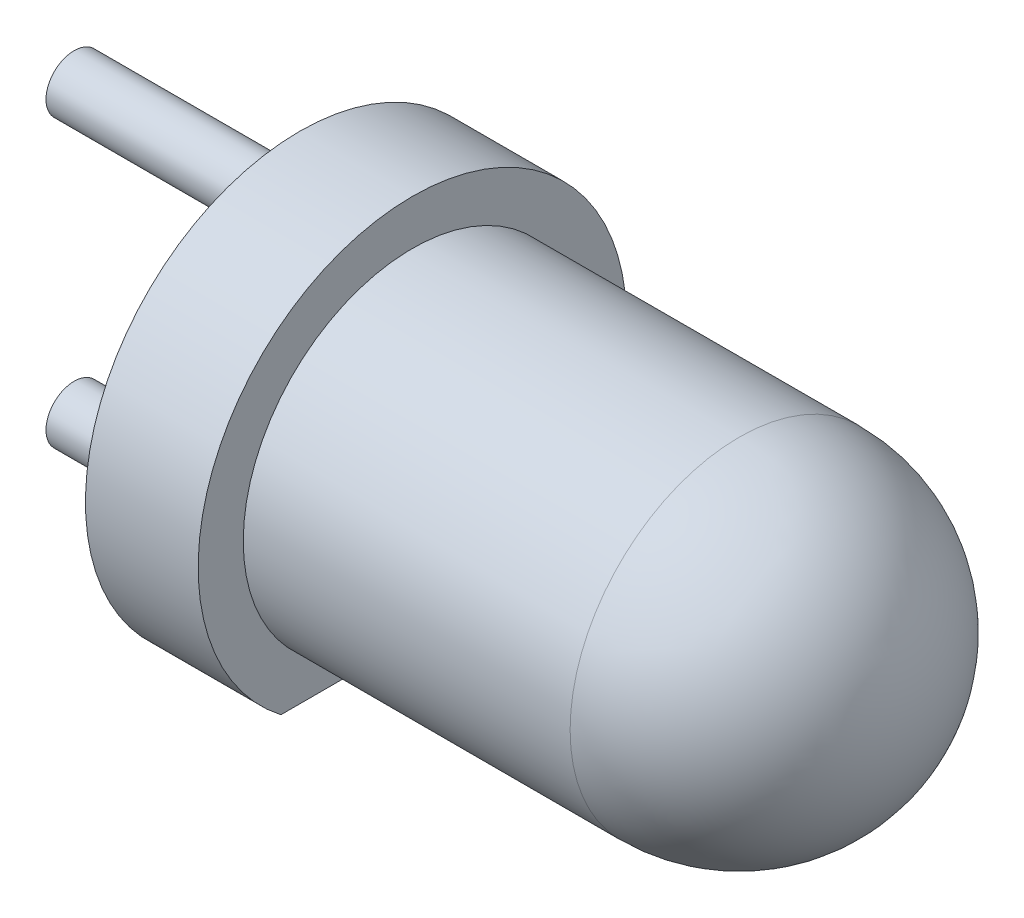
ISO-10303-21;
HEADER;
FILE_DESCRIPTION(('STEP AP214'),'2;1');
FILE_NAME('part.step','',(''),(''),'','','');
FILE_SCHEMA(('AUTOMOTIVE_DESIGN { 1 0 10303 214 1 1 1 1 }'));
ENDSEC;
DATA;
#1=APPLICATION_CONTEXT('core data for automotive mechanical design processes');
#2=APPLICATION_PROTOCOL_DEFINITION('international standard','automotive_design',2000,#1);
#3=PRODUCT_CONTEXT('',#1,'mechanical');
#4=PRODUCT('Part','Part','',(#3));
#5=PRODUCT_RELATED_PRODUCT_CATEGORY('part','',(#4));
#6=PRODUCT_DEFINITION_FORMATION('','',#4);
#7=PRODUCT_DEFINITION_CONTEXT('part definition',#1,'design');
#8=PRODUCT_DEFINITION('design','',#6,#7);
#9=PRODUCT_DEFINITION_SHAPE('','',#8);
#10=(LENGTH_UNIT() NAMED_UNIT(*) SI_UNIT(.MILLI.,.METRE.));
#11=(NAMED_UNIT(*) PLANE_ANGLE_UNIT() SI_UNIT($,.RADIAN.));
#12=(NAMED_UNIT(*) SI_UNIT($,.STERADIAN.) SOLID_ANGLE_UNIT());
#13=UNCERTAINTY_MEASURE_WITH_UNIT(LENGTH_MEASURE(1.E-05),#10,'distance_accuracy_value','');
#14=(GEOMETRIC_REPRESENTATION_CONTEXT(3) GLOBAL_UNCERTAINTY_ASSIGNED_CONTEXT((#13)) GLOBAL_UNIT_ASSIGNED_CONTEXT((#10,
#11,#12)) REPRESENTATION_CONTEXT('',''));
#15=CARTESIAN_POINT('',(0.,0.,0.));
#16=DIRECTION('',(0.,0.,1.));
#17=DIRECTION('',(1.,0.,0.));
#18=AXIS2_PLACEMENT_3D('',#15,#16,#17);
#19=CARTESIAN_POINT('',(-1.,0.,0.));
#20=DIRECTION('',(1.,0.,0.));
#21=DIRECTION('',(0.,0.,-1.));
#22=AXIS2_PLACEMENT_3D('',#19,#20,#21);
#23=PLANE('',#22);
#24=CARTESIAN_POINT('',(-1.,1.27,0.));
#25=DIRECTION('',(1.,0.,0.));
#26=DIRECTION('',(0.,0.,-1.));
#27=AXIS2_PLACEMENT_3D('',#24,#25,#26);
#28=CIRCLE('',#27,0.25);
#29=CARTESIAN_POINT('',(-1.,1.27,-0.25));
#30=VERTEX_POINT('',#29);
#31=EDGE_CURVE('E96',#30,#30,#28,.F.);
#32=ORIENTED_EDGE('',*,*,#31,.F.);
#33=EDGE_LOOP('',(#32));
#34=FACE_BOUND('',#33,.T.);
#35=CARTESIAN_POINT('',(-1.,0.,0.));
#36=DIRECTION('',(-1.,0.,0.));
#37=DIRECTION('',(0.,0.,1.));
#38=AXIS2_PLACEMENT_3D('',#35,#36,#37);
#39=CIRCLE('',#38,1.9);
#40=CARTESIAN_POINT('',(-1.,-1.5,1.16619037896906));
#41=VERTEX_POINT('',#40);
#42=CARTESIAN_POINT('',(-1.,-1.5,-1.16619037896906));
#43=VERTEX_POINT('',#42);
#44=EDGE_CURVE('E73',#41,#43,#39,.T.);
#45=ORIENTED_EDGE('',*,*,#44,.T.);
#46=DIRECTION('',(0.,0.,-1.));
#47=VECTOR('',#46,1.);
#48=CARTESIAN_POINT('',(-1.,-1.5,-1.86706033764857));
#49=LINE('',#48,#47);
#50=CARTESIAN_POINT('',(-1.,-1.5,-0.0979795897113272));
#51=VERTEX_POINT('',#50);
#52=EDGE_CURVE('E79',#51,#43,#49,.T.);
#53=ORIENTED_EDGE('',*,*,#52,.F.);
#54=CARTESIAN_POINT('',(-1.,-1.27,0.));
#55=DIRECTION('',(1.,0.,0.));
#56=DIRECTION('',(0.,0.,-1.));
#57=AXIS2_PLACEMENT_3D('',#54,#55,#56);
#58=CIRCLE('',#57,0.25);
#59=CARTESIAN_POINT('',(-1.,-1.5,0.0979795897113272));
#60=VERTEX_POINT('',#59);
#61=EDGE_CURVE('E75',#60,#51,#58,.F.);
#62=ORIENTED_EDGE('',*,*,#61,.F.);
#63=EDGE_CURVE('E42',#41,#60,#49,.T.);
#64=ORIENTED_EDGE('',*,*,#63,.F.);
#65=EDGE_LOOP('',(#45,#53,#62,#64));
#66=FACE_BOUND('',#65,.T.);
#67=ADVANCED_FACE('F28',(#34,#66),#23,.F.);
#68=CARTESIAN_POINT('',(2.9,0.,0.));
#69=DIRECTION('',(-1.,0.,0.));
#70=DIRECTION('',(0.,1.,0.));
#71=AXIS2_PLACEMENT_3D('',#68,#69,#70);
#72=SPHERICAL_SURFACE('',#71,1.5);
#73=CARTESIAN_POINT('',(2.9,0.,0.));
#74=DIRECTION('',(-1.,0.,0.));
#75=DIRECTION('',(0.,0.,1.));
#76=AXIS2_PLACEMENT_3D('',#73,#74,#75);
#77=CIRCLE('',#76,1.5);
#78=CARTESIAN_POINT('',(2.9,0.,1.5));
#79=VERTEX_POINT('',#78);
#80=EDGE_CURVE('E93',#79,#79,#77,.T.);
#81=ORIENTED_EDGE('',*,*,#80,.F.);
#82=EDGE_LOOP('',(#81));
#83=FACE_BOUND('',#82,.T.);
#84=ADVANCED_FACE('F119',(#83),#72,.T.);
#85=CARTESIAN_POINT('',(0.,0.,0.));
#86=DIRECTION('',(-1.,0.,0.));
#87=DIRECTION('',(0.,0.,1.));
#88=AXIS2_PLACEMENT_3D('',#85,#86,#87);
#89=CYLINDRICAL_SURFACE('',#88,1.5);
#90=CARTESIAN_POINT('',(0.,0.,0.));
#91=DIRECTION('',(-1.,0.,0.));
#92=DIRECTION('',(0.,0.,1.));
#93=AXIS2_PLACEMENT_3D('',#90,#91,#92);
#94=CIRCLE('',#93,1.5);
#95=CARTESIAN_POINT('',(0.,-1.5,0.));
#96=VERTEX_POINT('',#95);
#97=EDGE_CURVE('E84',#96,#96,#94,.T.);
#98=ORIENTED_EDGE('',*,*,#97,.F.);
#99=EDGE_LOOP('',(#98));
#100=FACE_BOUND('',#99,.T.);
#101=ORIENTED_EDGE('',*,*,#80,.T.);
#102=EDGE_LOOP('',(#101));
#103=FACE_BOUND('',#102,.T.);
#104=ADVANCED_FACE('F124',(#100,#103),#89,.T.);
#105=CARTESIAN_POINT('',(0.,1.5,0.));
#106=DIRECTION('',(-1.,0.,0.));
#107=DIRECTION('',(0.,0.,1.));
#108=AXIS2_PLACEMENT_3D('',#105,#106,#107);
#109=PLANE('',#108);
#110=CARTESIAN_POINT('',(0.,0.,0.));
#111=DIRECTION('',(-1.,0.,0.));
#112=DIRECTION('',(0.,0.,1.));
#113=AXIS2_PLACEMENT_3D('',#110,#111,#112);
#114=CIRCLE('',#113,1.9);
#115=CARTESIAN_POINT('',(0.,-1.5,1.16619037896906));
#116=VERTEX_POINT('',#115);
#117=CARTESIAN_POINT('',(0.,-1.5,-1.16619037896906));
#118=VERTEX_POINT('',#117);
#119=EDGE_CURVE('E81',#116,#118,#114,.T.);
#120=ORIENTED_EDGE('',*,*,#119,.F.);
#121=DIRECTION('',(0.,0.,-1.));
#122=VECTOR('',#121,1.);
#123=CARTESIAN_POINT('',(0.,-1.5,0.));
#124=LINE('',#123,#122);
#125=EDGE_CURVE('E63',#116,#96,#124,.T.);
#126=ORIENTED_EDGE('',*,*,#125,.T.);
#127=ORIENTED_EDGE('',*,*,#97,.T.);
#128=EDGE_CURVE('E147',#96,#118,#124,.T.);
#129=ORIENTED_EDGE('',*,*,#128,.T.);
#130=EDGE_LOOP('',(#120,#126,#127,#129));
#131=FACE_BOUND('',#130,.T.);
#132=ADVANCED_FACE('F133',(#131),#109,.F.);
#133=CARTESIAN_POINT('',(0.,0.,0.));
#134=DIRECTION('',(-1.,0.,0.));
#135=DIRECTION('',(0.,0.,1.));
#136=AXIS2_PLACEMENT_3D('',#133,#134,#135);
#137=CYLINDRICAL_SURFACE('',#136,1.9);
#138=ORIENTED_EDGE('',*,*,#119,.T.);
#139=DIRECTION('',(-1.,0.,0.));
#140=VECTOR('',#139,1.);
#141=CARTESIAN_POINT('',(0.,-1.5,-1.16619037896906));
#142=LINE('',#141,#140);
#143=EDGE_CURVE('E11',#118,#43,#142,.T.);
#144=ORIENTED_EDGE('',*,*,#143,.T.);
#145=ORIENTED_EDGE('',*,*,#44,.F.);
#146=DIRECTION('',(-1.,0.,0.));
#147=VECTOR('',#146,1.);
#148=CARTESIAN_POINT('',(0.,-1.5,1.16619037896906));
#149=LINE('',#148,#147);
#150=EDGE_CURVE('E35',#41,#116,#149,.F.);
#151=ORIENTED_EDGE('',*,*,#150,.T.);
#152=EDGE_LOOP('',(#138,#144,#145,#151));
#153=FACE_BOUND('',#152,.T.);
#154=ADVANCED_FACE('F80',(#153),#137,.T.);
#155=CARTESIAN_POINT('',(-3.,1.27,0.));
#156=DIRECTION('',(1.,0.,0.));
#157=DIRECTION('',(0.,0.,-1.));
#158=AXIS2_PLACEMENT_3D('',#155,#156,#157);
#159=CYLINDRICAL_SURFACE('',#158,0.25);
#160=CARTESIAN_POINT('',(-3.,1.27,0.));
#161=DIRECTION('',(-1.,0.,0.));
#162=DIRECTION('',(0.,0.,1.));
#163=AXIS2_PLACEMENT_3D('',#160,#161,#162);
#164=CIRCLE('',#163,0.25);
#165=CARTESIAN_POINT('',(-3.,1.27,0.25));
#166=VERTEX_POINT('',#165);
#167=EDGE_CURVE('E82',#166,#166,#164,.T.);
#168=ORIENTED_EDGE('',*,*,#167,.F.);
#169=EDGE_LOOP('',(#168));
#170=FACE_BOUND('',#169,.T.);
#171=ORIENTED_EDGE('',*,*,#31,.T.);
#172=EDGE_LOOP('',(#171));
#173=FACE_BOUND('',#172,.T.);
#174=ADVANCED_FACE('F114',(#170,#173),#159,.T.);
#175=CARTESIAN_POINT('',(-3.,1.27,0.));
#176=DIRECTION('',(-1.,0.,0.));
#177=DIRECTION('',(0.,0.,1.));
#178=AXIS2_PLACEMENT_3D('',#175,#176,#177);
#179=PLANE('',#178);
#180=ORIENTED_EDGE('',*,*,#167,.T.);
#181=EDGE_LOOP('',(#180));
#182=FACE_BOUND('',#181,.T.);
#183=ADVANCED_FACE('F103',(#182),#179,.T.);
#184=CARTESIAN_POINT('',(-3.,-1.27,0.));
#185=DIRECTION('',(1.,0.,0.));
#186=DIRECTION('',(0.,0.,-1.));
#187=AXIS2_PLACEMENT_3D('',#184,#185,#186);
#188=CYLINDRICAL_SURFACE('',#187,0.25);
#189=CARTESIAN_POINT('',(-3.,-1.27,0.));
#190=DIRECTION('',(-1.,0.,0.));
#191=DIRECTION('',(0.,0.,1.));
#192=AXIS2_PLACEMENT_3D('',#189,#190,#191);
#193=CIRCLE('',#192,0.25);
#194=CARTESIAN_POINT('',(-3.,-1.27,0.25));
#195=VERTEX_POINT('',#194);
#196=EDGE_CURVE('E87',#195,#195,#193,.T.);
#197=ORIENTED_EDGE('',*,*,#196,.F.);
#198=EDGE_LOOP('',(#197));
#199=FACE_BOUND('',#198,.T.);
#200=EDGE_CURVE('E68',#51,#60,#58,.F.);
#201=ORIENTED_EDGE('',*,*,#200,.T.);
#202=ORIENTED_EDGE('',*,*,#61,.T.);
#203=EDGE_LOOP('',(#201,#202));
#204=FACE_BOUND('',#203,.T.);
#205=ADVANCED_FACE('F100',(#199,#204),#188,.T.);
#206=CARTESIAN_POINT('',(-3.,-1.27,0.));
#207=DIRECTION('',(-1.,0.,0.));
#208=DIRECTION('',(0.,0.,1.));
#209=AXIS2_PLACEMENT_3D('',#206,#207,#208);
#210=PLANE('',#209);
#211=ORIENTED_EDGE('',*,*,#196,.T.);
#212=EDGE_LOOP('',(#211));
#213=FACE_BOUND('',#212,.T.);
#214=ADVANCED_FACE('F102',(#213),#210,.T.);
#215=CARTESIAN_POINT('',(3.,-1.5,-1.86706033764857));
#216=DIRECTION('',(0.,1.,0.));
#217=DIRECTION('',(0.,0.,1.));
#218=AXIS2_PLACEMENT_3D('',#215,#216,#217);
#219=PLANE('',#218);
#220=ORIENTED_EDGE('',*,*,#125,.F.);
#221=ORIENTED_EDGE('',*,*,#150,.F.);
#222=ORIENTED_EDGE('',*,*,#63,.T.);
#223=EDGE_CURVE('E77',#60,#51,#49,.T.);
#224=ORIENTED_EDGE('',*,*,#223,.T.);
#225=ORIENTED_EDGE('',*,*,#52,.T.);
#226=ORIENTED_EDGE('',*,*,#143,.F.);
#227=ORIENTED_EDGE('',*,*,#128,.F.);
#228=EDGE_LOOP('',(#220,#221,#222,#224,#225,#226,#227));
#229=FACE_BOUND('',#228,.T.);
#230=ADVANCED_FACE('F61',(#229),#219,.F.);
#231=CARTESIAN_POINT('',(-1.,-2.21728871728872,-1.86706033764857));
#232=DIRECTION('',(-1.,0.,0.));
#233=DIRECTION('',(0.,0.,1.));
#234=AXIS2_PLACEMENT_3D('',#231,#232,#233);
#235=PLANE('',#234);
#236=ORIENTED_EDGE('',*,*,#223,.F.);
#237=ORIENTED_EDGE('',*,*,#200,.F.);
#238=EDGE_LOOP('',(#236,#237));
#239=FACE_BOUND('',#238,.T.);
#240=ADVANCED_FACE('F151',(#239),#235,.F.);
#241=CLOSED_SHELL('',(#67,#84,#104,#132,#154,#174,#183,#205,#214,#230,#240));
#242=MANIFOLD_SOLID_BREP('B2',#241);
#243=ADVANCED_BREP_SHAPE_REPRESENTATION('',(#18,#242),#14);
#244=SHAPE_DEFINITION_REPRESENTATION(#9,#243);
ENDSEC;
END-ISO-10303-21;
